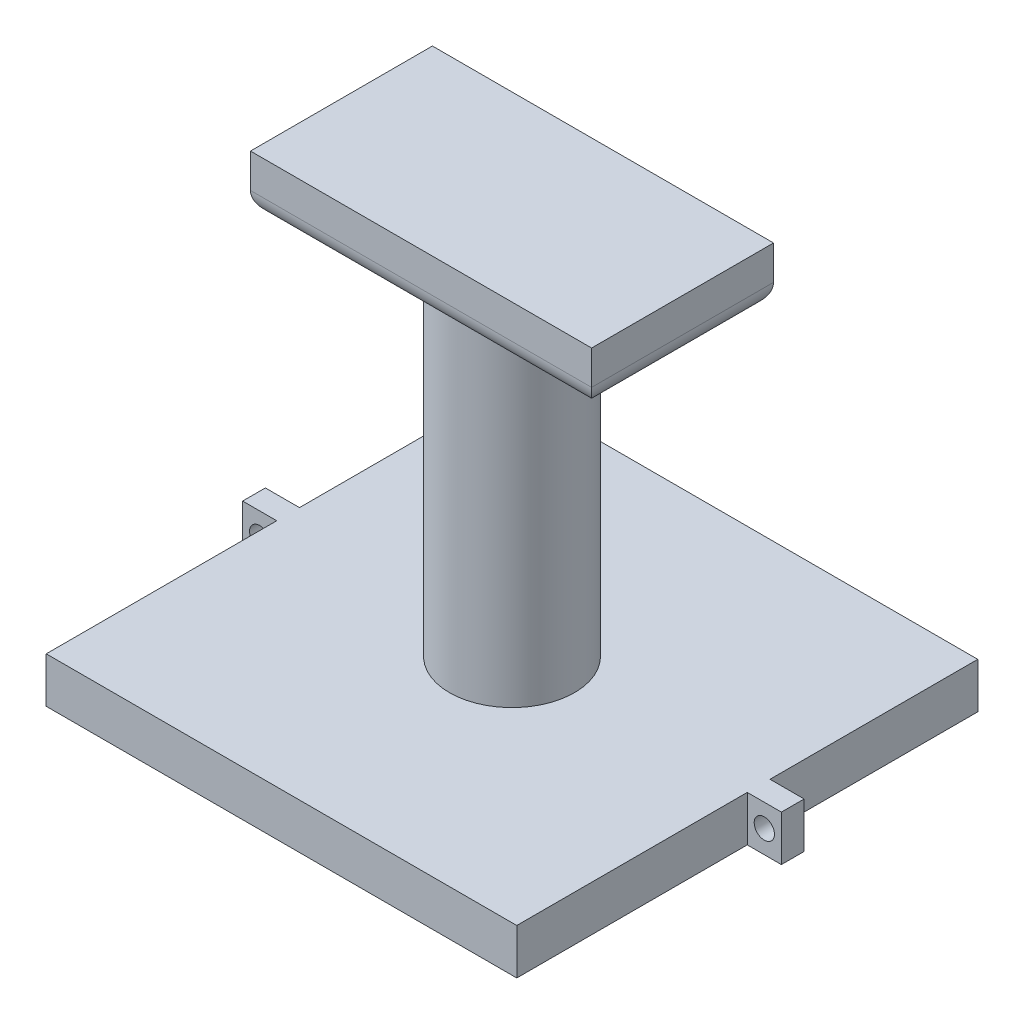
ISO-10303-21;
HEADER;
FILE_DESCRIPTION(('STEP AP214'),'2;1');
FILE_NAME('part.step','',(''),(''),'','','');
FILE_SCHEMA(('AUTOMOTIVE_DESIGN { 1 0 10303 214 1 1 1 1 }'));
ENDSEC;
DATA;
#1=APPLICATION_CONTEXT('core data for automotive mechanical design processes');
#2=APPLICATION_PROTOCOL_DEFINITION('international standard','automotive_design',2000,#1);
#3=PRODUCT_CONTEXT('',#1,'mechanical');
#4=PRODUCT('Part','Part','',(#3));
#5=PRODUCT_RELATED_PRODUCT_CATEGORY('part','',(#4));
#6=PRODUCT_DEFINITION_FORMATION('','',#4);
#7=PRODUCT_DEFINITION_CONTEXT('part definition',#1,'design');
#8=PRODUCT_DEFINITION('design','',#6,#7);
#9=PRODUCT_DEFINITION_SHAPE('','',#8);
#10=(LENGTH_UNIT() NAMED_UNIT(*) SI_UNIT(.MILLI.,.METRE.));
#11=(NAMED_UNIT(*) PLANE_ANGLE_UNIT() SI_UNIT($,.RADIAN.));
#12=(NAMED_UNIT(*) SI_UNIT($,.STERADIAN.) SOLID_ANGLE_UNIT());
#13=UNCERTAINTY_MEASURE_WITH_UNIT(LENGTH_MEASURE(1.E-05),#10,'distance_accuracy_value','');
#14=(GEOMETRIC_REPRESENTATION_CONTEXT(3) GLOBAL_UNCERTAINTY_ASSIGNED_CONTEXT((#13)) GLOBAL_UNIT_ASSIGNED_CONTEXT((#10,
#11,#12)) REPRESENTATION_CONTEXT('',''));
#15=CARTESIAN_POINT('',(0.,0.,0.));
#16=DIRECTION('',(0.,0.,1.));
#17=DIRECTION('',(1.,0.,0.));
#18=AXIS2_PLACEMENT_3D('',#15,#16,#17);
#19=CARTESIAN_POINT('',(0.,5.08,0.));
#20=DIRECTION('',(0.,0.,-1.));
#21=DIRECTION('',(-1.,0.,0.));
#22=AXIS2_PLACEMENT_3D('',#19,#20,#21);
#23=PLANE('',#22);
#24=CARTESIAN_POINT('',(28.1803602,2.54,0.));
#25=DIRECTION('',(0.,0.,1.));
#26=DIRECTION('',(1.,0.,0.));
#27=AXIS2_PLACEMENT_3D('',#24,#25,#26);
#28=CIRCLE('',#27,1.1303);
#29=CARTESIAN_POINT('',(29.3106602,2.54,0.));
#30=VERTEX_POINT('',#29);
#31=EDGE_CURVE('E235',#30,#30,#28,.T.);
#32=ORIENTED_EDGE('',*,*,#31,.F.);
#33=EDGE_LOOP('',(#32));
#34=FACE_BOUND('',#33,.T.);
#35=DIRECTION('',(1.,0.,0.));
#36=VECTOR('',#35,1.);
#37=CARTESIAN_POINT('',(0.,0.,0.));
#38=LINE('',#37,#36);
#39=CARTESIAN_POINT('',(26.2753602,0.,0.));
#40=VERTEX_POINT('',#39);
#41=CARTESIAN_POINT('',(30.0853602,0.,0.));
#42=VERTEX_POINT('',#41);
#43=EDGE_CURVE('E280',#40,#42,#38,.T.);
#44=ORIENTED_EDGE('',*,*,#43,.T.);
#45=DIRECTION('',(0.,-1.,0.));
#46=VECTOR('',#45,1.);
#47=CARTESIAN_POINT('',(30.0853602,5.08,0.));
#48=LINE('',#47,#46);
#49=CARTESIAN_POINT('',(30.0853602,5.08,0.));
#50=VERTEX_POINT('',#49);
#51=EDGE_CURVE('E402',#50,#42,#48,.T.);
#52=ORIENTED_EDGE('',*,*,#51,.F.);
#53=DIRECTION('',(1.,0.,0.));
#54=VECTOR('',#53,1.);
#55=CARTESIAN_POINT('',(0.,5.08,0.));
#56=LINE('',#55,#54);
#57=CARTESIAN_POINT('',(26.2753602,5.08,0.));
#58=VERTEX_POINT('',#57);
#59=EDGE_CURVE('E290',#58,#50,#56,.T.);
#60=ORIENTED_EDGE('',*,*,#59,.F.);
#61=DIRECTION('',(0.,-1.,0.));
#62=VECTOR('',#61,1.);
#63=CARTESIAN_POINT('',(26.2753602,5.08,0.));
#64=LINE('',#63,#62);
#65=EDGE_CURVE('E366',#58,#40,#64,.T.);
#66=ORIENTED_EDGE('',*,*,#65,.T.);
#67=EDGE_LOOP('',(#44,#52,#60,#66));
#68=FACE_BOUND('',#67,.T.);
#69=ADVANCED_FACE('F43',(#34,#68),#23,.F.);
#70=CARTESIAN_POINT('',(30.0853602,5.08,0.));
#71=DIRECTION('',(-1.,0.,0.));
#72=DIRECTION('',(0.,0.,1.));
#73=AXIS2_PLACEMENT_3D('',#70,#71,#72);
#74=PLANE('',#73);
#75=DIRECTION('',(0.,0.,-1.));
#76=VECTOR('',#75,1.);
#77=CARTESIAN_POINT('',(30.0853602,0.,0.));
#78=LINE('',#77,#76);
#79=CARTESIAN_POINT('',(30.0853602,0.,-2.54));
#80=VERTEX_POINT('',#79);
#81=EDGE_CURVE('E331',#42,#80,#78,.T.);
#82=ORIENTED_EDGE('',*,*,#81,.T.);
#83=DIRECTION('',(0.,-1.,0.));
#84=VECTOR('',#83,1.);
#85=CARTESIAN_POINT('',(30.0853602,5.08,-2.54));
#86=LINE('',#85,#84);
#87=CARTESIAN_POINT('',(30.0853602,5.08,-2.54));
#88=VERTEX_POINT('',#87);
#89=EDGE_CURVE('E399',#88,#80,#86,.T.);
#90=ORIENTED_EDGE('',*,*,#89,.F.);
#91=DIRECTION('',(0.,0.,-1.));
#92=VECTOR('',#91,1.);
#93=CARTESIAN_POINT('',(30.0853602,5.08,0.));
#94=LINE('',#93,#92);
#95=EDGE_CURVE('E294',#50,#88,#94,.T.);
#96=ORIENTED_EDGE('',*,*,#95,.F.);
#97=ORIENTED_EDGE('',*,*,#51,.T.);
#98=EDGE_LOOP('',(#82,#90,#96,#97));
#99=FACE_BOUND('',#98,.T.);
#100=ADVANCED_FACE('F487',(#99),#74,.F.);
#101=CARTESIAN_POINT('',(0.,5.08,-2.54));
#102=DIRECTION('',(0.,0.,-1.));
#103=DIRECTION('',(-1.,0.,0.));
#104=AXIS2_PLACEMENT_3D('',#101,#102,#103);
#105=PLANE('',#104);
#106=CARTESIAN_POINT('',(28.1803602,2.54,-2.54));
#107=DIRECTION('',(0.,0.,-1.));
#108=DIRECTION('',(-1.,0.,0.));
#109=AXIS2_PLACEMENT_3D('',#106,#107,#108);
#110=CIRCLE('',#109,1.1303);
#111=CARTESIAN_POINT('',(27.0500602,2.54,-2.54));
#112=VERTEX_POINT('',#111);
#113=EDGE_CURVE('E244',#112,#112,#110,.T.);
#114=ORIENTED_EDGE('',*,*,#113,.F.);
#115=EDGE_LOOP('',(#114));
#116=FACE_BOUND('',#115,.T.);
#117=DIRECTION('',(1.,0.,0.));
#118=VECTOR('',#117,1.);
#119=CARTESIAN_POINT('',(0.,0.,-2.54));
#120=LINE('',#119,#118);
#121=CARTESIAN_POINT('',(26.2753602,0.,-2.54));
#122=VERTEX_POINT('',#121);
#123=EDGE_CURVE('E335',#122,#80,#120,.T.);
#124=ORIENTED_EDGE('',*,*,#123,.F.);
#125=DIRECTION('',(0.,-1.,0.));
#126=VECTOR('',#125,1.);
#127=CARTESIAN_POINT('',(26.2753602,5.08,-2.54));
#128=LINE('',#127,#126);
#129=CARTESIAN_POINT('',(26.2753602,5.08,-2.54));
#130=VERTEX_POINT('',#129);
#131=EDGE_CURVE('E396',#130,#122,#128,.T.);
#132=ORIENTED_EDGE('',*,*,#131,.F.);
#133=DIRECTION('',(1.,0.,0.));
#134=VECTOR('',#133,1.);
#135=CARTESIAN_POINT('',(0.,5.08,-2.54));
#136=LINE('',#135,#134);
#137=EDGE_CURVE('E298',#130,#88,#136,.T.);
#138=ORIENTED_EDGE('',*,*,#137,.T.);
#139=ORIENTED_EDGE('',*,*,#89,.T.);
#140=EDGE_LOOP('',(#124,#132,#138,#139));
#141=FACE_BOUND('',#140,.T.);
#142=ADVANCED_FACE('F493',(#116,#141),#105,.T.);
#143=CARTESIAN_POINT('',(26.2753602,5.08,0.));
#144=DIRECTION('',(1.,0.,0.));
#145=DIRECTION('',(0.,0.,-1.));
#146=AXIS2_PLACEMENT_3D('',#143,#144,#145);
#147=PLANE('',#146);
#148=DIRECTION('',(0.,0.,1.));
#149=VECTOR('',#148,1.);
#150=CARTESIAN_POINT('',(26.2753602,0.,0.));
#151=LINE('',#150,#149);
#152=CARTESIAN_POINT('',(26.2753602,0.,-25.74299652));
#153=VERTEX_POINT('',#152);
#154=EDGE_CURVE('E339',#153,#122,#151,.T.);
#155=ORIENTED_EDGE('',*,*,#154,.F.);
#156=DIRECTION('',(0.,-1.,0.));
#157=VECTOR('',#156,1.);
#158=CARTESIAN_POINT('',(26.2753602,5.08,-25.74299652));
#159=LINE('',#158,#157);
#160=CARTESIAN_POINT('',(26.2753602,5.08,-25.74299652));
#161=VERTEX_POINT('',#160);
#162=EDGE_CURVE('E393',#161,#153,#159,.T.);
#163=ORIENTED_EDGE('',*,*,#162,.F.);
#164=DIRECTION('',(0.,0.,1.));
#165=VECTOR('',#164,1.);
#166=CARTESIAN_POINT('',(26.2753602,5.08,0.));
#167=LINE('',#166,#165);
#168=EDGE_CURVE('E302',#161,#130,#167,.T.);
#169=ORIENTED_EDGE('',*,*,#168,.T.);
#170=ORIENTED_EDGE('',*,*,#131,.T.);
#171=EDGE_LOOP('',(#155,#163,#169,#170));
#172=FACE_BOUND('',#171,.T.);
#173=ADVANCED_FACE('F575',(#172),#147,.T.);
#174=CARTESIAN_POINT('',(0.,5.08,-25.74299652));
#175=DIRECTION('',(0.,0.,-1.));
#176=DIRECTION('',(-1.,0.,0.));
#177=AXIS2_PLACEMENT_3D('',#174,#175,#176);
#178=PLANE('',#177);
#179=DIRECTION('',(1.,0.,0.));
#180=VECTOR('',#179,1.);
#181=CARTESIAN_POINT('',(0.,0.,-25.74299652));
#182=LINE('',#181,#180);
#183=CARTESIAN_POINT('',(-26.2753602,0.,-25.74299652));
#184=VERTEX_POINT('',#183);
#185=EDGE_CURVE('E343',#184,#153,#182,.T.);
#186=ORIENTED_EDGE('',*,*,#185,.F.);
#187=DIRECTION('',(0.,-1.,0.));
#188=VECTOR('',#187,1.);
#189=CARTESIAN_POINT('',(-26.2753602,5.08,-25.74299652));
#190=LINE('',#189,#188);
#191=CARTESIAN_POINT('',(-26.2753602,5.08,-25.74299652));
#192=VERTEX_POINT('',#191);
#193=EDGE_CURVE('E390',#192,#184,#190,.T.);
#194=ORIENTED_EDGE('',*,*,#193,.F.);
#195=DIRECTION('',(1.,0.,0.));
#196=VECTOR('',#195,1.);
#197=CARTESIAN_POINT('',(0.,5.08,-25.74299652));
#198=LINE('',#197,#196);
#199=EDGE_CURVE('E306',#192,#161,#198,.T.);
#200=ORIENTED_EDGE('',*,*,#199,.T.);
#201=ORIENTED_EDGE('',*,*,#162,.T.);
#202=EDGE_LOOP('',(#186,#194,#200,#201));
#203=FACE_BOUND('',#202,.T.);
#204=ADVANCED_FACE('F596',(#203),#178,.T.);
#205=CARTESIAN_POINT('',(-26.2753602,5.08,0.));
#206=DIRECTION('',(1.,0.,0.));
#207=DIRECTION('',(0.,0.,-1.));
#208=AXIS2_PLACEMENT_3D('',#205,#206,#207);
#209=PLANE('',#208);
#210=DIRECTION('',(0.,0.,1.));
#211=VECTOR('',#210,1.);
#212=CARTESIAN_POINT('',(-26.2753602,0.,0.));
#213=LINE('',#212,#211);
#214=CARTESIAN_POINT('',(-26.2753602,0.,-2.54001270000001));
#215=VERTEX_POINT('',#214);
#216=EDGE_CURVE('E347',#184,#215,#213,.T.);
#217=ORIENTED_EDGE('',*,*,#216,.T.);
#218=DIRECTION('',(0.,-1.,0.));
#219=VECTOR('',#218,1.);
#220=CARTESIAN_POINT('',(-26.2753602,5.08,-2.54001270000001));
#221=LINE('',#220,#219);
#222=CARTESIAN_POINT('',(-26.2753602,5.08,-2.54001270000001));
#223=VERTEX_POINT('',#222);
#224=EDGE_CURVE('E386',#223,#215,#221,.T.);
#225=ORIENTED_EDGE('',*,*,#224,.F.);
#226=DIRECTION('',(0.,0.,1.));
#227=VECTOR('',#226,1.);
#228=CARTESIAN_POINT('',(-26.2753602,5.08,0.));
#229=LINE('',#228,#227);
#230=EDGE_CURVE('E311',#192,#223,#229,.T.);
#231=ORIENTED_EDGE('',*,*,#230,.F.);
#232=ORIENTED_EDGE('',*,*,#193,.T.);
#233=EDGE_LOOP('',(#217,#225,#231,#232));
#234=FACE_BOUND('',#233,.T.);
#235=ADVANCED_FACE('F584',(#234),#209,.F.);
#236=CARTESIAN_POINT('',(0.,5.08,-2.54001270000002));
#237=DIRECTION('',(0.,0.,1.));
#238=DIRECTION('',(1.,0.,0.));
#239=AXIS2_PLACEMENT_3D('',#236,#237,#238);
#240=PLANE('',#239);
#241=CARTESIAN_POINT('',(-28.1803602,2.54,-2.54001270000001));
#242=DIRECTION('',(0.,0.,1.));
#243=DIRECTION('',(1.,0.,0.));
#244=AXIS2_PLACEMENT_3D('',#241,#242,#243);
#245=CIRCLE('',#244,1.1303);
#246=CARTESIAN_POINT('',(-27.0500602,2.54,-2.54001270000001));
#247=VERTEX_POINT('',#246);
#248=EDGE_CURVE('E240',#247,#247,#245,.T.);
#249=ORIENTED_EDGE('',*,*,#248,.T.);
#250=EDGE_LOOP('',(#249));
#251=FACE_BOUND('',#250,.T.);
#252=DIRECTION('',(-1.,0.,0.));
#253=VECTOR('',#252,1.);
#254=CARTESIAN_POINT('',(0.,0.,-2.54001270000002));
#255=LINE('',#254,#253);
#256=CARTESIAN_POINT('',(-30.0853602,0.,-2.54001270000001));
#257=VERTEX_POINT('',#256);
#258=EDGE_CURVE('E350',#215,#257,#255,.T.);
#259=ORIENTED_EDGE('',*,*,#258,.T.);
#260=DIRECTION('',(0.,-1.,0.));
#261=VECTOR('',#260,1.);
#262=CARTESIAN_POINT('',(-30.0853602,5.08,-2.54001270000001));
#263=LINE('',#262,#261);
#264=CARTESIAN_POINT('',(-30.0853602,5.08,-2.54001270000001));
#265=VERTEX_POINT('',#264);
#266=EDGE_CURVE('E382',#265,#257,#263,.T.);
#267=ORIENTED_EDGE('',*,*,#266,.F.);
#268=DIRECTION('',(-1.,0.,0.));
#269=VECTOR('',#268,1.);
#270=CARTESIAN_POINT('',(0.,5.08,-2.54001270000002));
#271=LINE('',#270,#269);
#272=EDGE_CURVE('E314',#223,#265,#271,.T.);
#273=ORIENTED_EDGE('',*,*,#272,.F.);
#274=ORIENTED_EDGE('',*,*,#224,.T.);
#275=EDGE_LOOP('',(#259,#267,#273,#274));
#276=FACE_BOUND('',#275,.T.);
#277=ADVANCED_FACE('F591',(#251,#276),#240,.F.);
#278=CARTESIAN_POINT('',(-30.0853602,5.08,0.));
#279=DIRECTION('',(1.,0.,0.));
#280=DIRECTION('',(0.,0.,-1.));
#281=AXIS2_PLACEMENT_3D('',#278,#279,#280);
#282=PLANE('',#281);
#283=DIRECTION('',(0.,0.,1.));
#284=VECTOR('',#283,1.);
#285=CARTESIAN_POINT('',(-30.0853602,0.,0.));
#286=LINE('',#285,#284);
#287=CARTESIAN_POINT('',(-30.0853602,0.,-1.27000000052969E-05));
#288=VERTEX_POINT('',#287);
#289=EDGE_CURVE('E354',#257,#288,#286,.T.);
#290=ORIENTED_EDGE('',*,*,#289,.T.);
#291=DIRECTION('',(0.,-1.,0.));
#292=VECTOR('',#291,1.);
#293=CARTESIAN_POINT('',(-30.0853602,5.08,-1.27000000052969E-05));
#294=LINE('',#293,#292);
#295=CARTESIAN_POINT('',(-30.0853602,5.08,-1.27000000052969E-05));
#296=VERTEX_POINT('',#295);
#297=EDGE_CURVE('E379',#296,#288,#294,.T.);
#298=ORIENTED_EDGE('',*,*,#297,.F.);
#299=DIRECTION('',(0.,0.,1.));
#300=VECTOR('',#299,1.);
#301=CARTESIAN_POINT('',(-30.0853602,5.08,0.));
#302=LINE('',#301,#300);
#303=EDGE_CURVE('E318',#265,#296,#302,.T.);
#304=ORIENTED_EDGE('',*,*,#303,.F.);
#305=ORIENTED_EDGE('',*,*,#266,.T.);
#306=EDGE_LOOP('',(#290,#298,#304,#305));
#307=FACE_BOUND('',#306,.T.);
#308=ADVANCED_FACE('F587',(#307),#282,.F.);
#309=CARTESIAN_POINT('',(0.,5.08,-1.26999999876622E-05));
#310=DIRECTION('',(0.,0.,1.));
#311=DIRECTION('',(1.,0.,0.));
#312=AXIS2_PLACEMENT_3D('',#309,#310,#311);
#313=PLANE('',#312);
#314=CARTESIAN_POINT('',(-28.1803602,2.54,-1.27000000043308E-05));
#315=DIRECTION('',(0.,0.,1.));
#316=DIRECTION('',(1.,0.,0.));
#317=AXIS2_PLACEMENT_3D('',#314,#315,#316);
#318=CIRCLE('',#317,1.1303);
#319=CARTESIAN_POINT('',(-27.0500602,2.54,-1.27000000036682E-05));
#320=VERTEX_POINT('',#319);
#321=EDGE_CURVE('E239',#320,#320,#318,.T.);
#322=ORIENTED_EDGE('',*,*,#321,.F.);
#323=EDGE_LOOP('',(#322));
#324=FACE_BOUND('',#323,.T.);
#325=DIRECTION('',(-1.,0.,0.));
#326=VECTOR('',#325,1.);
#327=CARTESIAN_POINT('',(0.,0.,-1.26999999876622E-05));
#328=LINE('',#327,#326);
#329=CARTESIAN_POINT('',(-26.2753602,0.,-1.27000000030636E-05));
#330=VERTEX_POINT('',#329);
#331=EDGE_CURVE('E358',#330,#288,#328,.T.);
#332=ORIENTED_EDGE('',*,*,#331,.F.);
#333=DIRECTION('',(0.,-1.,0.));
#334=VECTOR('',#333,1.);
#335=CARTESIAN_POINT('',(-26.2753602,5.08,-1.27000000030636E-05));
#336=LINE('',#335,#334);
#337=CARTESIAN_POINT('',(-26.2753602,5.08,-1.27000000030636E-05));
#338=VERTEX_POINT('',#337);
#339=EDGE_CURVE('E376',#338,#330,#336,.T.);
#340=ORIENTED_EDGE('',*,*,#339,.F.);
#341=DIRECTION('',(-1.,0.,0.));
#342=VECTOR('',#341,1.);
#343=CARTESIAN_POINT('',(0.,5.08,-1.26999999876622E-05));
#344=LINE('',#343,#342);
#345=EDGE_CURVE('E321',#338,#296,#344,.T.);
#346=ORIENTED_EDGE('',*,*,#345,.T.);
#347=ORIENTED_EDGE('',*,*,#297,.T.);
#348=EDGE_LOOP('',(#332,#340,#346,#347));
#349=FACE_BOUND('',#348,.T.);
#350=ADVANCED_FACE('F582',(#324,#349),#313,.T.);
#351=CARTESIAN_POINT('',(-26.2753602,0.,25.7429889));
#352=VERTEX_POINT('',#351);
#353=EDGE_CURVE('E351',#330,#352,#213,.T.);
#354=ORIENTED_EDGE('',*,*,#353,.T.);
#355=DIRECTION('',(0.,-1.,0.));
#356=VECTOR('',#355,1.);
#357=CARTESIAN_POINT('',(-26.2753602,5.08,25.7429889));
#358=LINE('',#357,#356);
#359=CARTESIAN_POINT('',(-26.2753602,5.08,25.7429889));
#360=VERTEX_POINT('',#359);
#361=EDGE_CURVE('E372',#360,#352,#358,.T.);
#362=ORIENTED_EDGE('',*,*,#361,.F.);
#363=EDGE_CURVE('E315',#338,#360,#229,.T.);
#364=ORIENTED_EDGE('',*,*,#363,.F.);
#365=ORIENTED_EDGE('',*,*,#339,.T.);
#366=EDGE_LOOP('',(#354,#362,#364,#365));
#367=FACE_BOUND('',#366,.T.);
#368=ADVANCED_FACE('F578',(#367),#209,.F.);
#369=CARTESIAN_POINT('',(0.,5.08,25.7429889));
#370=DIRECTION('',(0.,0.,-1.));
#371=DIRECTION('',(-1.,0.,0.));
#372=AXIS2_PLACEMENT_3D('',#369,#370,#371);
#373=PLANE('',#372);
#374=DIRECTION('',(1.,0.,0.));
#375=VECTOR('',#374,1.);
#376=CARTESIAN_POINT('',(0.,0.,25.7429889));
#377=LINE('',#376,#375);
#378=CARTESIAN_POINT('',(26.2753602,0.,25.7429889));
#379=VERTEX_POINT('',#378);
#380=EDGE_CURVE('E362',#352,#379,#377,.T.);
#381=ORIENTED_EDGE('',*,*,#380,.T.);
#382=DIRECTION('',(0.,-1.,0.));
#383=VECTOR('',#382,1.);
#384=CARTESIAN_POINT('',(26.2753602,5.08,25.7429889));
#385=LINE('',#384,#383);
#386=CARTESIAN_POINT('',(26.2753602,5.08,25.7429889));
#387=VERTEX_POINT('',#386);
#388=EDGE_CURVE('E369',#387,#379,#385,.T.);
#389=ORIENTED_EDGE('',*,*,#388,.F.);
#390=DIRECTION('',(1.,0.,0.));
#391=VECTOR('',#390,1.);
#392=CARTESIAN_POINT('',(0.,5.08,25.7429889));
#393=LINE('',#392,#391);
#394=EDGE_CURVE('E325',#360,#387,#393,.T.);
#395=ORIENTED_EDGE('',*,*,#394,.F.);
#396=ORIENTED_EDGE('',*,*,#361,.T.);
#397=EDGE_LOOP('',(#381,#389,#395,#396));
#398=FACE_BOUND('',#397,.T.);
#399=ADVANCED_FACE('F573',(#398),#373,.F.);
#400=EDGE_CURVE('E295',#40,#379,#151,.T.);
#401=ORIENTED_EDGE('',*,*,#400,.F.);
#402=ORIENTED_EDGE('',*,*,#65,.F.);
#403=EDGE_CURVE('E307',#58,#387,#167,.T.);
#404=ORIENTED_EDGE('',*,*,#403,.T.);
#405=ORIENTED_EDGE('',*,*,#388,.T.);
#406=EDGE_LOOP('',(#401,#402,#404,#405));
#407=FACE_BOUND('',#406,.T.);
#408=ADVANCED_FACE('F566',(#407),#147,.T.);
#409=CARTESIAN_POINT('',(0.,5.08,0.));
#410=DIRECTION('',(0.,1.,0.));
#411=DIRECTION('',(0.,0.,1.));
#412=AXIS2_PLACEMENT_3D('',#409,#410,#411);
#413=PLANE('',#412);
#414=CARTESIAN_POINT('',(0.,5.08,0.));
#415=DIRECTION('',(0.,1.,0.));
#416=DIRECTION('',(0.,0.,1.));
#417=AXIS2_PLACEMENT_3D('',#414,#415,#416);
#418=CIRCLE('',#417,6.985);
#419=CARTESIAN_POINT('',(0.,5.08,6.985));
#420=VERTEX_POINT('',#419);
#421=EDGE_CURVE('E221',#420,#420,#418,.T.);
#422=ORIENTED_EDGE('',*,*,#421,.F.);
#423=EDGE_LOOP('',(#422));
#424=FACE_BOUND('',#423,.T.);
#425=ORIENTED_EDGE('',*,*,#59,.T.);
#426=ORIENTED_EDGE('',*,*,#95,.T.);
#427=ORIENTED_EDGE('',*,*,#137,.F.);
#428=ORIENTED_EDGE('',*,*,#168,.F.);
#429=ORIENTED_EDGE('',*,*,#199,.F.);
#430=ORIENTED_EDGE('',*,*,#230,.T.);
#431=ORIENTED_EDGE('',*,*,#272,.T.);
#432=ORIENTED_EDGE('',*,*,#303,.T.);
#433=ORIENTED_EDGE('',*,*,#345,.F.);
#434=ORIENTED_EDGE('',*,*,#363,.T.);
#435=ORIENTED_EDGE('',*,*,#394,.T.);
#436=ORIENTED_EDGE('',*,*,#403,.F.);
#437=EDGE_LOOP('',(#425,#426,#427,#428,#429,#430,#431,#432,#433,#434,#435,#436));
#438=FACE_BOUND('',#437,.T.);
#439=ADVANCED_FACE('F563',(#424,#438),#413,.T.);
#440=CARTESIAN_POINT('',(0.,0.,0.));
#441=DIRECTION('',(0.,1.,0.));
#442=DIRECTION('',(0.,0.,1.));
#443=AXIS2_PLACEMENT_3D('',#440,#441,#442);
#444=PLANE('',#443);
#445=DIRECTION('',(0.,0.,1.));
#446=VECTOR('',#445,1.);
#447=CARTESIAN_POINT('',(23.7353602,0.,-23.20299652));
#448=LINE('',#447,#446);
#449=CARTESIAN_POINT('',(23.7353602,0.,-23.20299652));
#450=VERTEX_POINT('',#449);
#451=CARTESIAN_POINT('',(23.7353602,0.,23.2029889));
#452=VERTEX_POINT('',#451);
#453=EDGE_CURVE('E266',#450,#452,#448,.T.);
#454=ORIENTED_EDGE('',*,*,#453,.F.);
#455=DIRECTION('',(1.,0.,0.));
#456=VECTOR('',#455,1.);
#457=CARTESIAN_POINT('',(23.7353602,0.,-23.20299652));
#458=LINE('',#457,#456);
#459=CARTESIAN_POINT('',(-23.7353602,0.,-23.20299652));
#460=VERTEX_POINT('',#459);
#461=EDGE_CURVE('E263',#460,#450,#458,.T.);
#462=ORIENTED_EDGE('',*,*,#461,.F.);
#463=DIRECTION('',(0.,0.,-1.));
#464=VECTOR('',#463,1.);
#465=CARTESIAN_POINT('',(-23.7353602,0.,-23.20299652));
#466=LINE('',#465,#464);
#467=CARTESIAN_POINT('',(-23.7353602,0.,23.2029889));
#468=VERTEX_POINT('',#467);
#469=EDGE_CURVE('E250',#468,#460,#466,.T.);
#470=ORIENTED_EDGE('',*,*,#469,.F.);
#471=DIRECTION('',(-1.,0.,0.));
#472=VECTOR('',#471,1.);
#473=CARTESIAN_POINT('',(23.7353602,0.,23.2029889));
#474=LINE('',#473,#472);
#475=EDGE_CURVE('E270',#452,#468,#474,.T.);
#476=ORIENTED_EDGE('',*,*,#475,.F.);
#477=EDGE_LOOP('',(#454,#462,#470,#476));
#478=FACE_BOUND('',#477,.T.);
#479=ORIENTED_EDGE('',*,*,#43,.F.);
#480=ORIENTED_EDGE('',*,*,#400,.T.);
#481=ORIENTED_EDGE('',*,*,#380,.F.);
#482=ORIENTED_EDGE('',*,*,#353,.F.);
#483=ORIENTED_EDGE('',*,*,#331,.T.);
#484=ORIENTED_EDGE('',*,*,#289,.F.);
#485=ORIENTED_EDGE('',*,*,#258,.F.);
#486=ORIENTED_EDGE('',*,*,#216,.F.);
#487=ORIENTED_EDGE('',*,*,#185,.T.);
#488=ORIENTED_EDGE('',*,*,#154,.T.);
#489=ORIENTED_EDGE('',*,*,#123,.T.);
#490=ORIENTED_EDGE('',*,*,#81,.F.);
#491=EDGE_LOOP('',(#479,#480,#481,#482,#483,#484,#485,#486,#487,#488,#489,#490));
#492=FACE_BOUND('',#491,.T.);
#493=ADVANCED_FACE('F561',(#478,#492),#444,.F.);
#494=CARTESIAN_POINT('',(23.7353602,3.81,-23.20299652));
#495=DIRECTION('',(0.,0.,-1.));
#496=DIRECTION('',(-1.,0.,0.));
#497=AXIS2_PLACEMENT_3D('',#494,#495,#496);
#498=PLANE('',#497);
#499=ORIENTED_EDGE('',*,*,#461,.T.);
#500=DIRECTION('',(0.,-1.,0.));
#501=VECTOR('',#500,1.);
#502=CARTESIAN_POINT('',(23.7353602,3.81,-23.20299652));
#503=LINE('',#502,#501);
#504=CARTESIAN_POINT('',(23.7353602,3.81,-23.20299652));
#505=VERTEX_POINT('',#504);
#506=EDGE_CURVE('E262',#505,#450,#503,.T.);
#507=ORIENTED_EDGE('',*,*,#506,.F.);
#508=DIRECTION('',(1.,0.,0.));
#509=VECTOR('',#508,1.);
#510=CARTESIAN_POINT('',(23.7353602,3.81,-23.20299652));
#511=LINE('',#510,#509);
#512=CARTESIAN_POINT('',(-23.7353602,3.81,-23.20299652));
#513=VERTEX_POINT('',#512);
#514=EDGE_CURVE('E245',#513,#505,#511,.T.);
#515=ORIENTED_EDGE('',*,*,#514,.F.);
#516=DIRECTION('',(0.,-1.,0.));
#517=VECTOR('',#516,1.);
#518=CARTESIAN_POINT('',(-23.7353602,3.81,-23.20299652));
#519=LINE('',#518,#517);
#520=EDGE_CURVE('E277',#513,#460,#519,.T.);
#521=ORIENTED_EDGE('',*,*,#520,.T.);
#522=EDGE_LOOP('',(#499,#507,#515,#521));
#523=FACE_BOUND('',#522,.T.);
#524=ADVANCED_FACE('F551',(#523),#498,.F.);
#525=CARTESIAN_POINT('',(-23.7353602,3.81,-23.20299652));
#526=DIRECTION('',(-1.,0.,0.));
#527=DIRECTION('',(0.,0.,1.));
#528=AXIS2_PLACEMENT_3D('',#525,#526,#527);
#529=PLANE('',#528);
#530=ORIENTED_EDGE('',*,*,#469,.T.);
#531=ORIENTED_EDGE('',*,*,#520,.F.);
#532=DIRECTION('',(0.,0.,-1.));
#533=VECTOR('',#532,1.);
#534=CARTESIAN_POINT('',(-23.7353602,3.81,-23.20299652));
#535=LINE('',#534,#533);
#536=CARTESIAN_POINT('',(-23.7353602,3.81,23.2029889));
#537=VERTEX_POINT('',#536);
#538=EDGE_CURVE('E258',#537,#513,#535,.T.);
#539=ORIENTED_EDGE('',*,*,#538,.F.);
#540=DIRECTION('',(0.,-1.,0.));
#541=VECTOR('',#540,1.);
#542=CARTESIAN_POINT('',(-23.7353602,3.81,23.2029889));
#543=LINE('',#542,#541);
#544=EDGE_CURVE('E281',#537,#468,#543,.T.);
#545=ORIENTED_EDGE('',*,*,#544,.T.);
#546=EDGE_LOOP('',(#530,#531,#539,#545));
#547=FACE_BOUND('',#546,.T.);
#548=ADVANCED_FACE('F547',(#547),#529,.F.);
#549=CARTESIAN_POINT('',(23.7353602,3.81,23.2029889));
#550=DIRECTION('',(0.,0.,1.));
#551=DIRECTION('',(1.,0.,0.));
#552=AXIS2_PLACEMENT_3D('',#549,#550,#551);
#553=PLANE('',#552);
#554=ORIENTED_EDGE('',*,*,#475,.T.);
#555=ORIENTED_EDGE('',*,*,#544,.F.);
#556=DIRECTION('',(-1.,0.,0.));
#557=VECTOR('',#556,1.);
#558=CARTESIAN_POINT('',(23.7353602,3.81,23.2029889));
#559=LINE('',#558,#557);
#560=CARTESIAN_POINT('',(23.7353602,3.81,23.2029889));
#561=VERTEX_POINT('',#560);
#562=EDGE_CURVE('E254',#561,#537,#559,.T.);
#563=ORIENTED_EDGE('',*,*,#562,.F.);
#564=DIRECTION('',(0.,-1.,0.));
#565=VECTOR('',#564,1.);
#566=CARTESIAN_POINT('',(23.7353602,3.81,23.2029889));
#567=LINE('',#566,#565);
#568=EDGE_CURVE('E284',#561,#452,#567,.T.);
#569=ORIENTED_EDGE('',*,*,#568,.T.);
#570=EDGE_LOOP('',(#554,#555,#563,#569));
#571=FACE_BOUND('',#570,.T.);
#572=ADVANCED_FACE('F550',(#571),#553,.F.);
#573=CARTESIAN_POINT('',(23.7353602,3.81,-23.20299652));
#574=DIRECTION('',(1.,0.,0.));
#575=DIRECTION('',(0.,0.,-1.));
#576=AXIS2_PLACEMENT_3D('',#573,#574,#575);
#577=PLANE('',#576);
#578=ORIENTED_EDGE('',*,*,#453,.T.);
#579=ORIENTED_EDGE('',*,*,#568,.F.);
#580=DIRECTION('',(0.,0.,1.));
#581=VECTOR('',#580,1.);
#582=CARTESIAN_POINT('',(23.7353602,3.81,-23.20299652));
#583=LINE('',#582,#581);
#584=EDGE_CURVE('E249',#505,#561,#583,.T.);
#585=ORIENTED_EDGE('',*,*,#584,.F.);
#586=ORIENTED_EDGE('',*,*,#506,.T.);
#587=EDGE_LOOP('',(#578,#579,#585,#586));
#588=FACE_BOUND('',#587,.T.);
#589=ADVANCED_FACE('F545',(#588),#577,.F.);
#590=CARTESIAN_POINT('',(0.,3.81,0.));
#591=DIRECTION('',(0.,1.,0.));
#592=DIRECTION('',(0.,0.,1.));
#593=AXIS2_PLACEMENT_3D('',#590,#591,#592);
#594=PLANE('',#593);
#595=CARTESIAN_POINT('',(0.,3.81,0.));
#596=DIRECTION('',(0.,1.,0.));
#597=DIRECTION('',(0.,0.,1.));
#598=AXIS2_PLACEMENT_3D('',#595,#596,#597);
#599=CIRCLE('',#598,5.08);
#600=CARTESIAN_POINT('',(0.,3.81,5.08));
#601=VERTEX_POINT('',#600);
#602=EDGE_CURVE('E231',#601,#601,#599,.T.);
#603=ORIENTED_EDGE('',*,*,#602,.T.);
#604=EDGE_LOOP('',(#603));
#605=FACE_BOUND('',#604,.T.);
#606=ORIENTED_EDGE('',*,*,#514,.T.);
#607=ORIENTED_EDGE('',*,*,#584,.T.);
#608=ORIENTED_EDGE('',*,*,#562,.T.);
#609=ORIENTED_EDGE('',*,*,#538,.T.);
#610=EDGE_LOOP('',(#606,#607,#608,#609));
#611=FACE_BOUND('',#610,.T.);
#612=ADVANCED_FACE('F541',(#605,#611),#594,.F.);
#613=CARTESIAN_POINT('',(-28.1803602,2.54,-3.302));
#614=DIRECTION('',(0.,0.,1.));
#615=DIRECTION('',(1.,0.,0.));
#616=AXIS2_PLACEMENT_3D('',#613,#614,#615);
#617=CYLINDRICAL_SURFACE('',#616,1.1303);
#618=ORIENTED_EDGE('',*,*,#321,.T.);
#619=EDGE_LOOP('',(#618));
#620=FACE_BOUND('',#619,.T.);
#621=ORIENTED_EDGE('',*,*,#248,.F.);
#622=EDGE_LOOP('',(#621));
#623=FACE_BOUND('',#622,.T.);
#624=ADVANCED_FACE('F537',(#620,#623),#617,.F.);
#625=CARTESIAN_POINT('',(28.1803602,2.54,-3.302));
#626=DIRECTION('',(0.,0.,1.));
#627=DIRECTION('',(1.,0.,0.));
#628=AXIS2_PLACEMENT_3D('',#625,#626,#627);
#629=CYLINDRICAL_SURFACE('',#628,1.1303);
#630=ORIENTED_EDGE('',*,*,#113,.T.);
#631=EDGE_LOOP('',(#630));
#632=FACE_BOUND('',#631,.T.);
#633=ORIENTED_EDGE('',*,*,#31,.T.);
#634=EDGE_LOOP('',(#633));
#635=FACE_BOUND('',#634,.T.);
#636=ADVANCED_FACE('F528',(#632,#635),#629,.F.);
#637=CARTESIAN_POINT('',(0.,3.1496,0.));
#638=DIRECTION('',(0.,1.,0.));
#639=DIRECTION('',(0.,0.,1.));
#640=AXIS2_PLACEMENT_3D('',#637,#638,#639);
#641=CYLINDRICAL_SURFACE('',#640,5.08);
#642=ORIENTED_EDGE('',*,*,#602,.F.);
#643=EDGE_LOOP('',(#642));
#644=FACE_BOUND('',#643,.T.);
#645=CARTESIAN_POINT('',(0.,43.18,0.));
#646=DIRECTION('',(0.,1.,0.));
#647=DIRECTION('',(0.,0.,1.));
#648=AXIS2_PLACEMENT_3D('',#645,#646,#647);
#649=CIRCLE('',#648,5.08);
#650=CARTESIAN_POINT('',(0.,43.18,5.08));
#651=VERTEX_POINT('',#650);
#652=EDGE_CURVE('E216',#651,#651,#649,.T.);
#653=ORIENTED_EDGE('',*,*,#652,.T.);
#654=EDGE_LOOP('',(#653));
#655=FACE_BOUND('',#654,.T.);
#656=ADVANCED_FACE('F522',(#644,#655),#641,.F.);
#657=CARTESIAN_POINT('',(0.,43.18,0.));
#658=DIRECTION('',(0.,-1.,0.));
#659=DIRECTION('',(0.,0.,-1.));
#660=AXIS2_PLACEMENT_3D('',#657,#658,#659);
#661=CYLINDRICAL_SURFACE('',#660,6.985);
#662=CARTESIAN_POINT('',(0.,43.18,0.));
#663=DIRECTION('',(0.,1.,0.));
#664=DIRECTION('',(0.,0.,1.));
#665=AXIS2_PLACEMENT_3D('',#662,#663,#664);
#666=CIRCLE('',#665,6.985);
#667=CARTESIAN_POINT('',(0.,43.18,6.985));
#668=VERTEX_POINT('',#667);
#669=EDGE_CURVE('E227',#668,#668,#666,.T.);
#670=ORIENTED_EDGE('',*,*,#669,.F.);
#671=EDGE_LOOP('',(#670));
#672=FACE_BOUND('',#671,.T.);
#673=ORIENTED_EDGE('',*,*,#421,.T.);
#674=EDGE_LOOP('',(#673));
#675=FACE_BOUND('',#674,.T.);
#676=ADVANCED_FACE('F518',(#672,#675),#661,.T.);
#677=CARTESIAN_POINT('',(0.,43.18,0.));
#678=DIRECTION('',(0.,-1.,0.));
#679=DIRECTION('',(0.,0.,-1.));
#680=AXIS2_PLACEMENT_3D('',#677,#678,#679);
#681=PLANE('',#680);
#682=DIRECTION('',(-1.,0.,0.));
#683=VECTOR('',#682,1.);
#684=CARTESIAN_POINT('',(19.05,43.18,-7.62));
#685=LINE('',#684,#683);
#686=CARTESIAN_POINT('',(-16.51,43.18,-7.62));
#687=VERTEX_POINT('',#686);
#688=CARTESIAN_POINT('',(16.51,43.18,-7.62));
#689=VERTEX_POINT('',#688);
#690=EDGE_CURVE('E425',#687,#689,#685,.F.);
#691=ORIENTED_EDGE('',*,*,#690,.T.);
#692=DIRECTION('',(0.,0.,-1.));
#693=VECTOR('',#692,1.);
#694=CARTESIAN_POINT('',(16.51,43.18,10.16));
#695=LINE('',#694,#693);
#696=CARTESIAN_POINT('',(16.51,43.18,7.62));
#697=VERTEX_POINT('',#696);
#698=EDGE_CURVE('E428',#689,#697,#695,.F.);
#699=ORIENTED_EDGE('',*,*,#698,.T.);
#700=DIRECTION('',(1.,0.,0.));
#701=VECTOR('',#700,1.);
#702=CARTESIAN_POINT('',(-19.05,43.18,7.62));
#703=LINE('',#702,#701);
#704=CARTESIAN_POINT('',(-16.51,43.18,7.62));
#705=VERTEX_POINT('',#704);
#706=EDGE_CURVE('E419',#697,#705,#703,.F.);
#707=ORIENTED_EDGE('',*,*,#706,.T.);
#708=DIRECTION('',(0.,0.,1.));
#709=VECTOR('',#708,1.);
#710=CARTESIAN_POINT('',(-16.51,43.18,-10.16));
#711=LINE('',#710,#709);
#712=EDGE_CURVE('E422',#705,#687,#711,.F.);
#713=ORIENTED_EDGE('',*,*,#712,.T.);
#714=EDGE_LOOP('',(#691,#699,#707,#713));
#715=FACE_BOUND('',#714,.T.);
#716=ORIENTED_EDGE('',*,*,#669,.T.);
#717=EDGE_LOOP('',(#716));
#718=FACE_BOUND('',#717,.T.);
#719=ADVANCED_FACE('F457',(#715,#718),#681,.T.);
#720=CARTESIAN_POINT('',(0.,49.53,0.));
#721=DIRECTION('',(0.,-1.,0.));
#722=DIRECTION('',(0.,0.,-1.));
#723=AXIS2_PLACEMENT_3D('',#720,#721,#722);
#724=PLANE('',#723);
#725=DIRECTION('',(0.,0.,1.));
#726=VECTOR('',#725,1.);
#727=CARTESIAN_POINT('',(-19.05,49.53,10.16));
#728=LINE('',#727,#726);
#729=CARTESIAN_POINT('',(-19.05,49.53,-10.16));
#730=VERTEX_POINT('',#729);
#731=CARTESIAN_POINT('',(-19.05,49.53,10.16));
#732=VERTEX_POINT('',#731);
#733=EDGE_CURVE('E206',#730,#732,#728,.T.);
#734=ORIENTED_EDGE('',*,*,#733,.T.);
#735=DIRECTION('',(1.,0.,0.));
#736=VECTOR('',#735,1.);
#737=CARTESIAN_POINT('',(-19.05,49.53,10.16));
#738=LINE('',#737,#736);
#739=CARTESIAN_POINT('',(19.05,49.53,10.16));
#740=VERTEX_POINT('',#739);
#741=EDGE_CURVE('E195',#732,#740,#738,.T.);
#742=ORIENTED_EDGE('',*,*,#741,.T.);
#743=DIRECTION('',(0.,0.,-1.));
#744=VECTOR('',#743,1.);
#745=CARTESIAN_POINT('',(19.05,49.53,10.16));
#746=LINE('',#745,#744);
#747=CARTESIAN_POINT('',(19.05,49.53,-10.16));
#748=VERTEX_POINT('',#747);
#749=EDGE_CURVE('E205',#740,#748,#746,.T.);
#750=ORIENTED_EDGE('',*,*,#749,.T.);
#751=DIRECTION('',(-1.,0.,0.));
#752=VECTOR('',#751,1.);
#753=CARTESIAN_POINT('',(-19.05,49.53,-10.16));
#754=LINE('',#753,#752);
#755=EDGE_CURVE('E211',#748,#730,#754,.T.);
#756=ORIENTED_EDGE('',*,*,#755,.T.);
#757=EDGE_LOOP('',(#734,#742,#750,#756));
#758=FACE_BOUND('',#757,.T.);
#759=ADVANCED_FACE('F209',(#758),#724,.F.);
#760=CARTESIAN_POINT('',(-19.05,49.53,-10.16));
#761=DIRECTION('',(0.,0.,1.));
#762=DIRECTION('',(1.,0.,0.));
#763=AXIS2_PLACEMENT_3D('',#760,#761,#762);
#764=PLANE('',#763);
#765=DIRECTION('',(0.,-1.,0.));
#766=VECTOR('',#765,1.);
#767=CARTESIAN_POINT('',(19.05,49.53,-10.16));
#768=LINE('',#767,#766);
#769=CARTESIAN_POINT('',(19.05,45.72,-10.16));
#770=VERTEX_POINT('',#769);
#771=EDGE_CURVE('E223',#748,#770,#768,.T.);
#772=ORIENTED_EDGE('',*,*,#771,.T.);
#773=DIRECTION('',(-1.,0.,0.));
#774=VECTOR('',#773,1.);
#775=CARTESIAN_POINT('',(-19.05,45.72,-10.16));
#776=LINE('',#775,#774);
#777=CARTESIAN_POINT('',(-19.05,45.72,-10.16));
#778=VERTEX_POINT('',#777);
#779=EDGE_CURVE('E68',#770,#778,#776,.T.);
#780=ORIENTED_EDGE('',*,*,#779,.T.);
#781=DIRECTION('',(0.,-1.,0.));
#782=VECTOR('',#781,1.);
#783=CARTESIAN_POINT('',(-19.05,49.53,-10.16));
#784=LINE('',#783,#782);
#785=EDGE_CURVE('E470',#730,#778,#784,.T.);
#786=ORIENTED_EDGE('',*,*,#785,.F.);
#787=ORIENTED_EDGE('',*,*,#755,.F.);
#788=EDGE_LOOP('',(#772,#780,#786,#787));
#789=FACE_BOUND('',#788,.T.);
#790=ADVANCED_FACE('F468',(#789),#764,.F.);
#791=CARTESIAN_POINT('',(19.05,49.53,10.16));
#792=DIRECTION('',(-1.,0.,0.));
#793=DIRECTION('',(0.,0.,1.));
#794=AXIS2_PLACEMENT_3D('',#791,#792,#793);
#795=PLANE('',#794);
#796=DIRECTION('',(0.,-1.,0.));
#797=VECTOR('',#796,1.);
#798=CARTESIAN_POINT('',(19.05,49.53,10.16));
#799=LINE('',#798,#797);
#800=CARTESIAN_POINT('',(19.05,45.72,10.16));
#801=VERTEX_POINT('',#800);
#802=EDGE_CURVE('E201',#740,#801,#799,.T.);
#803=ORIENTED_EDGE('',*,*,#802,.T.);
#804=DIRECTION('',(0.,0.,-1.));
#805=VECTOR('',#804,1.);
#806=CARTESIAN_POINT('',(19.05,45.72,-10.16));
#807=LINE('',#806,#805);
#808=EDGE_CURVE('E406',#801,#770,#807,.T.);
#809=ORIENTED_EDGE('',*,*,#808,.T.);
#810=ORIENTED_EDGE('',*,*,#771,.F.);
#811=ORIENTED_EDGE('',*,*,#749,.F.);
#812=EDGE_LOOP('',(#803,#809,#810,#811));
#813=FACE_BOUND('',#812,.T.);
#814=ADVANCED_FACE('F467',(#813),#795,.F.);
#815=CARTESIAN_POINT('',(-19.05,49.53,10.16));
#816=DIRECTION('',(0.,0.,-1.));
#817=DIRECTION('',(-1.,0.,0.));
#818=AXIS2_PLACEMENT_3D('',#815,#816,#817);
#819=PLANE('',#818);
#820=DIRECTION('',(0.,-1.,0.));
#821=VECTOR('',#820,1.);
#822=CARTESIAN_POINT('',(-19.05,49.53,10.16));
#823=LINE('',#822,#821);
#824=CARTESIAN_POINT('',(-19.05,45.72,10.16));
#825=VERTEX_POINT('',#824);
#826=EDGE_CURVE('E198',#732,#825,#823,.T.);
#827=ORIENTED_EDGE('',*,*,#826,.T.);
#828=DIRECTION('',(1.,0.,0.));
#829=VECTOR('',#828,1.);
#830=CARTESIAN_POINT('',(19.05,45.72,10.16));
#831=LINE('',#830,#829);
#832=EDGE_CURVE('E11',#825,#801,#831,.T.);
#833=ORIENTED_EDGE('',*,*,#832,.T.);
#834=ORIENTED_EDGE('',*,*,#802,.F.);
#835=ORIENTED_EDGE('',*,*,#741,.F.);
#836=EDGE_LOOP('',(#827,#833,#834,#835));
#837=FACE_BOUND('',#836,.T.);
#838=ADVANCED_FACE('F197',(#837),#819,.F.);
#839=CARTESIAN_POINT('',(-19.05,49.53,10.16));
#840=DIRECTION('',(1.,0.,0.));
#841=DIRECTION('',(0.,0.,-1.));
#842=AXIS2_PLACEMENT_3D('',#839,#840,#841);
#843=PLANE('',#842);
#844=ORIENTED_EDGE('',*,*,#785,.T.);
#845=DIRECTION('',(0.,0.,1.));
#846=VECTOR('',#845,1.);
#847=CARTESIAN_POINT('',(-19.05,45.72,10.16));
#848=LINE('',#847,#846);
#849=EDGE_CURVE('E53',#778,#825,#848,.T.);
#850=ORIENTED_EDGE('',*,*,#849,.T.);
#851=ORIENTED_EDGE('',*,*,#826,.F.);
#852=ORIENTED_EDGE('',*,*,#733,.F.);
#853=EDGE_LOOP('',(#844,#850,#851,#852));
#854=FACE_BOUND('',#853,.T.);
#855=ADVANCED_FACE('F214',(#854),#843,.F.);
#856=ORIENTED_EDGE('',*,*,#652,.F.);
#857=EDGE_LOOP('',(#856));
#858=FACE_BOUND('',#857,.T.);
#859=ADVANCED_FACE('F507',(#858),#681,.T.);
#860=CARTESIAN_POINT('',(-16.51,45.72,10.16));
#861=DIRECTION('',(0.,0.,-1.));
#862=DIRECTION('',(-1.,0.,0.));
#863=AXIS2_PLACEMENT_3D('',#860,#861,#862);
#864=CYLINDRICAL_SURFACE('',#863,2.54);
#865=CARTESIAN_POINT('',(-16.51,45.72,-7.62));
#866=DIRECTION('',(0.707106781186547,0.,-0.707106781186548));
#867=DIRECTION('',(-0.707106781186548,0.,-0.707106781186547));
#868=AXIS2_PLACEMENT_3D('',#865,#866,#867);
#869=ELLIPSE('',#868,3.59210244842766,2.54);
#870=EDGE_CURVE('E441',#687,#778,#869,.T.);
#871=ORIENTED_EDGE('',*,*,#870,.F.);
#872=ORIENTED_EDGE('',*,*,#712,.F.);
#873=CARTESIAN_POINT('',(-16.51,45.72,7.62));
#874=DIRECTION('',(-0.707106781186548,0.,-0.707106781186547));
#875=DIRECTION('',(-0.707106781186547,0.,0.707106781186548));
#876=AXIS2_PLACEMENT_3D('',#873,#874,#875);
#877=ELLIPSE('',#876,3.59210244842766,2.54);
#878=EDGE_CURVE('E47',#825,#705,#877,.F.);
#879=ORIENTED_EDGE('',*,*,#878,.F.);
#880=ORIENTED_EDGE('',*,*,#849,.F.);
#881=EDGE_LOOP('',(#871,#872,#879,#880));
#882=FACE_BOUND('',#881,.T.);
#883=ADVANCED_FACE('F45',(#882),#864,.T.);
#884=CARTESIAN_POINT('',(-19.05,45.72,7.62));
#885=DIRECTION('',(-1.,0.,0.));
#886=DIRECTION('',(0.,0.,1.));
#887=AXIS2_PLACEMENT_3D('',#884,#885,#886);
#888=CYLINDRICAL_SURFACE('',#887,2.54);
#889=ORIENTED_EDGE('',*,*,#878,.T.);
#890=ORIENTED_EDGE('',*,*,#706,.F.);
#891=CARTESIAN_POINT('',(16.51,45.72,7.62));
#892=DIRECTION('',(-0.707106781186547,0.,0.707106781186548));
#893=DIRECTION('',(-0.707106781186548,0.,-0.707106781186547));
#894=AXIS2_PLACEMENT_3D('',#891,#892,#893);
#895=ELLIPSE('',#894,3.59210244842766,2.54);
#896=EDGE_CURVE('E439',#801,#697,#895,.F.);
#897=ORIENTED_EDGE('',*,*,#896,.F.);
#898=ORIENTED_EDGE('',*,*,#832,.F.);
#899=EDGE_LOOP('',(#889,#890,#897,#898));
#900=FACE_BOUND('',#899,.T.);
#901=ADVANCED_FACE('F452',(#900),#888,.T.);
#902=CARTESIAN_POINT('',(-19.05,45.72,-7.62));
#903=DIRECTION('',(1.,0.,0.));
#904=DIRECTION('',(0.,0.,-1.));
#905=AXIS2_PLACEMENT_3D('',#902,#903,#904);
#906=CYLINDRICAL_SURFACE('',#905,2.54);
#907=ORIENTED_EDGE('',*,*,#870,.T.);
#908=ORIENTED_EDGE('',*,*,#779,.F.);
#909=CARTESIAN_POINT('',(16.51,45.72,-7.62));
#910=DIRECTION('',(0.707106781186548,0.,0.707106781186547));
#911=DIRECTION('',(0.707106781186547,0.,-0.707106781186548));
#912=AXIS2_PLACEMENT_3D('',#909,#910,#911);
#913=ELLIPSE('',#912,3.59210244842766,2.54);
#914=EDGE_CURVE('E436',#689,#770,#913,.T.);
#915=ORIENTED_EDGE('',*,*,#914,.F.);
#916=ORIENTED_EDGE('',*,*,#690,.F.);
#917=EDGE_LOOP('',(#907,#908,#915,#916));
#918=FACE_BOUND('',#917,.T.);
#919=ADVANCED_FACE('F464',(#918),#906,.T.);
#920=CARTESIAN_POINT('',(16.51,45.72,10.16));
#921=DIRECTION('',(0.,0.,1.));
#922=DIRECTION('',(1.,0.,0.));
#923=AXIS2_PLACEMENT_3D('',#920,#921,#922);
#924=CYLINDRICAL_SURFACE('',#923,2.54);
#925=ORIENTED_EDGE('',*,*,#896,.T.);
#926=ORIENTED_EDGE('',*,*,#698,.F.);
#927=ORIENTED_EDGE('',*,*,#914,.T.);
#928=ORIENTED_EDGE('',*,*,#808,.F.);
#929=EDGE_LOOP('',(#925,#926,#927,#928));
#930=FACE_BOUND('',#929,.T.);
#931=ADVANCED_FACE('F462',(#930),#924,.T.);
#932=CLOSED_SHELL('',(#69,#100,#142,#173,#204,#235,#277,#308,#350,#368,#399,#408,#439,#493,#524,
#548,#572,#589,#612,#624,#636,#656,#676,#719,#759,#790,#814,#838,#855,#859,#883,#901,#919,#931));
#933=MANIFOLD_SOLID_BREP('B2',#932);
#934=ADVANCED_BREP_SHAPE_REPRESENTATION('',(#18,#933),#14);
#935=SHAPE_DEFINITION_REPRESENTATION(#9,#934);
ENDSEC;
END-ISO-10303-21;
